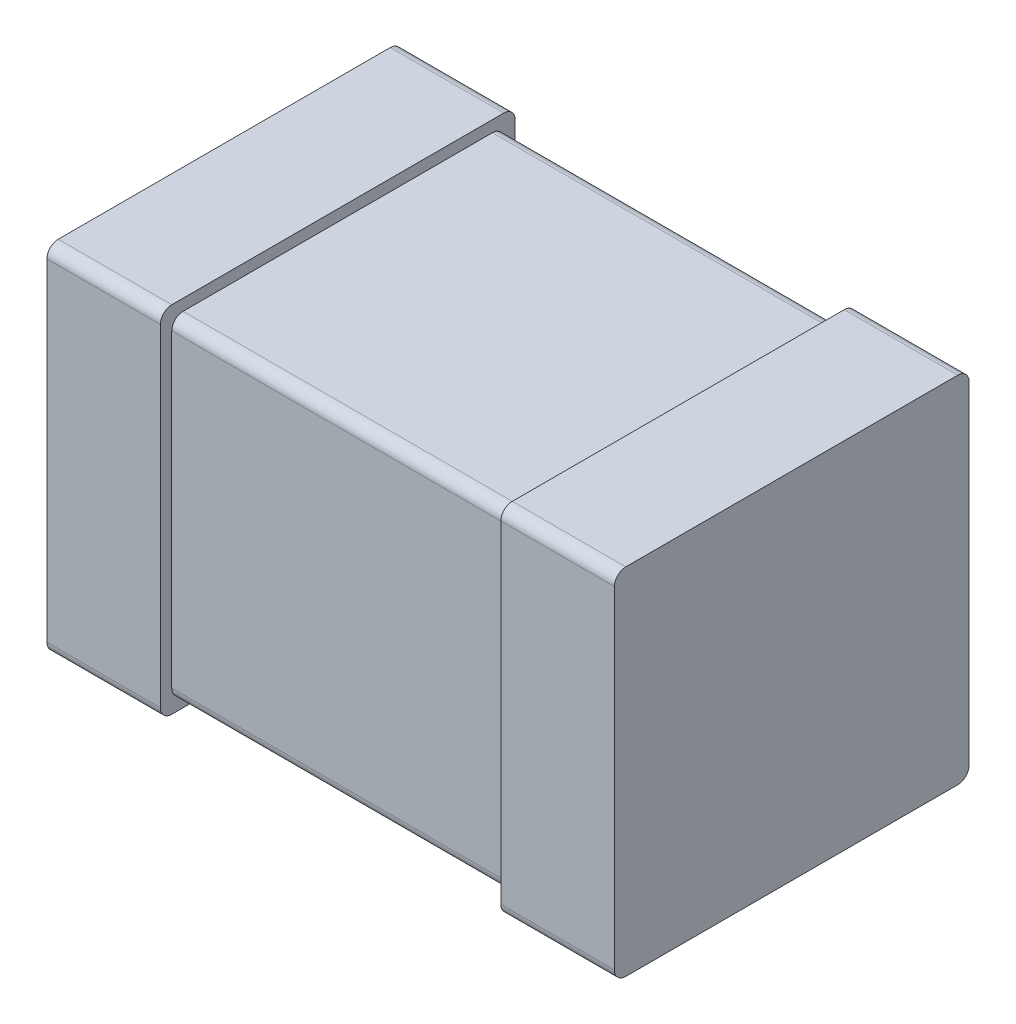
ISO-10303-21;
HEADER;
FILE_DESCRIPTION(('STEP AP214'),'2;1');
FILE_NAME('part.step','',(''),(''),'','','');
FILE_SCHEMA(('AUTOMOTIVE_DESIGN { 1 0 10303 214 1 1 1 1 }'));
ENDSEC;
DATA;
#1=APPLICATION_CONTEXT('core data for automotive mechanical design processes');
#2=APPLICATION_PROTOCOL_DEFINITION('international standard','automotive_design',2000,#1);
#3=PRODUCT_CONTEXT('',#1,'mechanical');
#4=PRODUCT('Part','Part','',(#3));
#5=PRODUCT_RELATED_PRODUCT_CATEGORY('part','',(#4));
#6=PRODUCT_DEFINITION_FORMATION('','',#4);
#7=PRODUCT_DEFINITION_CONTEXT('part definition',#1,'design');
#8=PRODUCT_DEFINITION('design','',#6,#7);
#9=PRODUCT_DEFINITION_SHAPE('','',#8);
#10=(LENGTH_UNIT() NAMED_UNIT(*) SI_UNIT(.MILLI.,.METRE.));
#11=(NAMED_UNIT(*) PLANE_ANGLE_UNIT() SI_UNIT($,.RADIAN.));
#12=(NAMED_UNIT(*) SI_UNIT($,.STERADIAN.) SOLID_ANGLE_UNIT());
#13=UNCERTAINTY_MEASURE_WITH_UNIT(LENGTH_MEASURE(1.E-05),#10,'distance_accuracy_value','');
#14=(GEOMETRIC_REPRESENTATION_CONTEXT(3) GLOBAL_UNCERTAINTY_ASSIGNED_CONTEXT((#13)) GLOBAL_UNIT_ASSIGNED_CONTEXT((#10,
#11,#12)) REPRESENTATION_CONTEXT('',''));
#15=CARTESIAN_POINT('',(0.,0.,0.));
#16=DIRECTION('',(0.,0.,1.));
#17=DIRECTION('',(1.,0.,0.));
#18=AXIS2_PLACEMENT_3D('',#15,#16,#17);
#19=CARTESIAN_POINT('',(1.,-0.625,0.));
#20=DIRECTION('',(1.,0.,0.));
#21=DIRECTION('',(0.,1.,0.));
#22=AXIS2_PLACEMENT_3D('',#19,#20,#21);
#23=PLANE('',#22);
#24=DIRECTION('',(0.,0.,1.));
#25=VECTOR('',#24,1.);
#26=CARTESIAN_POINT('',(1.,-0.625,0.));
#27=LINE('',#26,#25);
#28=CARTESIAN_POINT('',(1.,-0.625,0.04));
#29=VERTEX_POINT('',#28);
#30=CARTESIAN_POINT('',(1.,-0.625,1.21));
#31=VERTEX_POINT('',#30);
#32=EDGE_CURVE('E421',#29,#31,#27,.T.);
#33=ORIENTED_EDGE('',*,*,#32,.F.);
#34=CARTESIAN_POINT('',(1.,-0.585,0.04));
#35=DIRECTION('',(1.,0.,0.));
#36=DIRECTION('',(0.,0.,1.));
#37=AXIS2_PLACEMENT_3D('',#34,#35,#36);
#38=CIRCLE('',#37,0.04);
#39=CARTESIAN_POINT('',(1.,-0.585,0.));
#40=VERTEX_POINT('',#39);
#41=EDGE_CURVE('E294',#29,#40,#38,.T.);
#42=ORIENTED_EDGE('',*,*,#41,.T.);
#43=DIRECTION('',(0.,1.,0.));
#44=VECTOR('',#43,1.);
#45=CARTESIAN_POINT('',(1.,-0.625,0.));
#46=LINE('',#45,#44);
#47=CARTESIAN_POINT('',(1.,0.585,0.));
#48=VERTEX_POINT('',#47);
#49=EDGE_CURVE('E327',#40,#48,#46,.T.);
#50=ORIENTED_EDGE('',*,*,#49,.T.);
#51=CARTESIAN_POINT('',(1.,0.585,0.04));
#52=DIRECTION('',(-1.,0.,0.));
#53=DIRECTION('',(0.,0.,1.));
#54=AXIS2_PLACEMENT_3D('',#51,#52,#53);
#55=CIRCLE('',#54,0.04);
#56=CARTESIAN_POINT('',(1.,0.625,0.04));
#57=VERTEX_POINT('',#56);
#58=EDGE_CURVE('E342',#57,#48,#55,.T.);
#59=ORIENTED_EDGE('',*,*,#58,.F.);
#60=DIRECTION('',(0.,0.,1.));
#61=VECTOR('',#60,1.);
#62=CARTESIAN_POINT('',(1.,0.625,0.));
#63=LINE('',#62,#61);
#64=CARTESIAN_POINT('',(1.,0.625,1.21));
#65=VERTEX_POINT('',#64);
#66=EDGE_CURVE('E11',#57,#65,#63,.T.);
#67=ORIENTED_EDGE('',*,*,#66,.T.);
#68=CARTESIAN_POINT('',(1.,0.585,1.21));
#69=DIRECTION('',(1.,0.,0.));
#70=DIRECTION('',(0.,0.,1.));
#71=AXIS2_PLACEMENT_3D('',#68,#69,#70);
#72=CIRCLE('',#71,0.04);
#73=CARTESIAN_POINT('',(1.,0.585,1.25));
#74=VERTEX_POINT('',#73);
#75=EDGE_CURVE('E397',#65,#74,#72,.T.);
#76=ORIENTED_EDGE('',*,*,#75,.T.);
#77=DIRECTION('',(0.,1.,0.));
#78=VECTOR('',#77,1.);
#79=CARTESIAN_POINT('',(1.,-0.625,1.25));
#80=LINE('',#79,#78);
#81=CARTESIAN_POINT('',(1.,-0.585,1.25));
#82=VERTEX_POINT('',#81);
#83=EDGE_CURVE('E322',#82,#74,#80,.T.);
#84=ORIENTED_EDGE('',*,*,#83,.F.);
#85=CARTESIAN_POINT('',(1.,-0.585,1.21));
#86=DIRECTION('',(-1.,0.,0.));
#87=DIRECTION('',(0.,0.,1.));
#88=AXIS2_PLACEMENT_3D('',#85,#86,#87);
#89=CIRCLE('',#88,0.04);
#90=EDGE_CURVE('E298',#31,#82,#89,.T.);
#91=ORIENTED_EDGE('',*,*,#90,.F.);
#92=EDGE_LOOP('',(#33,#42,#50,#59,#67,#76,#84,#91));
#93=FACE_BOUND('',#92,.T.);
#94=ADVANCED_FACE('F17',(#93),#23,.T.);
#95=CARTESIAN_POINT('',(0.6,0.625,0.));
#96=DIRECTION('',(0.,1.,0.));
#97=DIRECTION('',(1.,0.,0.));
#98=AXIS2_PLACEMENT_3D('',#95,#96,#97);
#99=PLANE('',#98);
#100=ORIENTED_EDGE('',*,*,#66,.F.);
#101=DIRECTION('',(1.,0.,0.));
#102=VECTOR('',#101,1.);
#103=CARTESIAN_POINT('',(0.6,0.625,0.04));
#104=LINE('',#103,#102);
#105=CARTESIAN_POINT('',(0.6,0.625,0.04));
#106=VERTEX_POINT('',#105);
#107=EDGE_CURVE('E338',#106,#57,#104,.T.);
#108=ORIENTED_EDGE('',*,*,#107,.F.);
#109=DIRECTION('',(0.,0.,1.));
#110=VECTOR('',#109,1.);
#111=CARTESIAN_POINT('',(0.6,0.625,0.));
#112=LINE('',#111,#110);
#113=CARTESIAN_POINT('',(0.6,0.625,1.21));
#114=VERTEX_POINT('',#113);
#115=EDGE_CURVE('E357',#106,#114,#112,.T.);
#116=ORIENTED_EDGE('',*,*,#115,.T.);
#117=DIRECTION('',(1.,0.,0.));
#118=VECTOR('',#117,1.);
#119=CARTESIAN_POINT('',(0.6,0.625,1.21));
#120=LINE('',#119,#118);
#121=EDGE_CURVE('E28',#114,#65,#120,.T.);
#122=ORIENTED_EDGE('',*,*,#121,.T.);
#123=EDGE_LOOP('',(#100,#108,#116,#122));
#124=FACE_BOUND('',#123,.T.);
#125=ADVANCED_FACE('F521',(#124),#99,.T.);
#126=CARTESIAN_POINT('',(0.6,0.585,1.21));
#127=DIRECTION('',(1.,0.,0.));
#128=DIRECTION('',(0.,1.,0.));
#129=AXIS2_PLACEMENT_3D('',#126,#127,#128);
#130=CYLINDRICAL_SURFACE('',#129,0.04);
#131=CARTESIAN_POINT('',(0.6,0.585,1.21));
#132=DIRECTION('',(1.,0.,0.));
#133=DIRECTION('',(0.,0.,1.));
#134=AXIS2_PLACEMENT_3D('',#131,#132,#133);
#135=CIRCLE('',#134,0.04);
#136=CARTESIAN_POINT('',(0.6,0.585,1.25));
#137=VERTEX_POINT('',#136);
#138=EDGE_CURVE('E321',#114,#137,#135,.T.);
#139=ORIENTED_EDGE('',*,*,#138,.T.);
#140=DIRECTION('',(1.,0.,0.));
#141=VECTOR('',#140,1.);
#142=CARTESIAN_POINT('',(0.6,0.585,1.25));
#143=LINE('',#142,#141);
#144=EDGE_CURVE('E326',#137,#74,#143,.T.);
#145=ORIENTED_EDGE('',*,*,#144,.T.);
#146=ORIENTED_EDGE('',*,*,#75,.F.);
#147=ORIENTED_EDGE('',*,*,#121,.F.);
#148=EDGE_LOOP('',(#139,#145,#146,#147));
#149=FACE_BOUND('',#148,.T.);
#150=ADVANCED_FACE('F528',(#149),#130,.T.);
#151=CARTESIAN_POINT('',(0.6,0.585,0.04));
#152=DIRECTION('',(1.,0.,0.));
#153=DIRECTION('',(0.,1.,0.));
#154=AXIS2_PLACEMENT_3D('',#151,#152,#153);
#155=CYLINDRICAL_SURFACE('',#154,0.04);
#156=ORIENTED_EDGE('',*,*,#107,.T.);
#157=ORIENTED_EDGE('',*,*,#58,.T.);
#158=DIRECTION('',(1.,0.,0.));
#159=VECTOR('',#158,1.);
#160=CARTESIAN_POINT('',(0.6,0.585,0.));
#161=LINE('',#160,#159);
#162=CARTESIAN_POINT('',(0.6,0.585,0.));
#163=VERTEX_POINT('',#162);
#164=EDGE_CURVE('E365',#163,#48,#161,.T.);
#165=ORIENTED_EDGE('',*,*,#164,.F.);
#166=CARTESIAN_POINT('',(0.6,0.585,0.04));
#167=DIRECTION('',(-1.,0.,0.));
#168=DIRECTION('',(0.,0.,1.));
#169=AXIS2_PLACEMENT_3D('',#166,#167,#168);
#170=CIRCLE('',#169,0.04);
#171=EDGE_CURVE('E352',#106,#163,#170,.T.);
#172=ORIENTED_EDGE('',*,*,#171,.F.);
#173=EDGE_LOOP('',(#156,#157,#165,#172));
#174=FACE_BOUND('',#173,.T.);
#175=ADVANCED_FACE('F547',(#174),#155,.T.);
#176=CARTESIAN_POINT('',(0.6,-0.625,1.25));
#177=DIRECTION('',(0.,0.,1.));
#178=DIRECTION('',(1.,0.,0.));
#179=AXIS2_PLACEMENT_3D('',#176,#177,#178);
#180=PLANE('',#179);
#181=DIRECTION('',(0.,1.,0.));
#182=VECTOR('',#181,1.);
#183=CARTESIAN_POINT('',(0.6,-0.625,1.25));
#184=LINE('',#183,#182);
#185=CARTESIAN_POINT('',(0.6,-0.585,1.25));
#186=VERTEX_POINT('',#185);
#187=EDGE_CURVE('E317',#186,#137,#184,.T.);
#188=ORIENTED_EDGE('',*,*,#187,.F.);
#189=DIRECTION('',(1.,0.,0.));
#190=VECTOR('',#189,1.);
#191=CARTESIAN_POINT('',(0.6,-0.585,1.25));
#192=LINE('',#191,#190);
#193=EDGE_CURVE('E281',#186,#82,#192,.T.);
#194=ORIENTED_EDGE('',*,*,#193,.T.);
#195=ORIENTED_EDGE('',*,*,#83,.T.);
#196=ORIENTED_EDGE('',*,*,#144,.F.);
#197=EDGE_LOOP('',(#188,#194,#195,#196));
#198=FACE_BOUND('',#197,.T.);
#199=ADVANCED_FACE('F532',(#198),#180,.T.);
#200=CARTESIAN_POINT('',(0.6,-0.625,0.));
#201=DIRECTION('',(0.,0.,1.));
#202=DIRECTION('',(1.,0.,0.));
#203=AXIS2_PLACEMENT_3D('',#200,#201,#202);
#204=PLANE('',#203);
#205=ORIENTED_EDGE('',*,*,#164,.T.);
#206=ORIENTED_EDGE('',*,*,#49,.F.);
#207=DIRECTION('',(1.,0.,0.));
#208=VECTOR('',#207,1.);
#209=CARTESIAN_POINT('',(0.6,-0.585,0.));
#210=LINE('',#209,#208);
#211=CARTESIAN_POINT('',(0.6,-0.585,0.));
#212=VERTEX_POINT('',#211);
#213=EDGE_CURVE('E21',#212,#40,#210,.T.);
#214=ORIENTED_EDGE('',*,*,#213,.F.);
#215=DIRECTION('',(0.,1.,0.));
#216=VECTOR('',#215,1.);
#217=CARTESIAN_POINT('',(0.6,-0.625,0.));
#218=LINE('',#217,#216);
#219=EDGE_CURVE('E356',#212,#163,#218,.T.);
#220=ORIENTED_EDGE('',*,*,#219,.T.);
#221=EDGE_LOOP('',(#205,#206,#214,#220));
#222=FACE_BOUND('',#221,.T.);
#223=ADVANCED_FACE('F545',(#222),#204,.F.);
#224=CARTESIAN_POINT('',(0.6,-0.585,1.21));
#225=DIRECTION('',(1.,0.,0.));
#226=DIRECTION('',(0.,-1.,0.));
#227=AXIS2_PLACEMENT_3D('',#224,#225,#226);
#228=CYLINDRICAL_SURFACE('',#227,0.04);
#229=DIRECTION('',(1.,0.,0.));
#230=VECTOR('',#229,1.);
#231=CARTESIAN_POINT('',(0.6,-0.625,1.21));
#232=LINE('',#231,#230);
#233=CARTESIAN_POINT('',(0.6,-0.625,1.21));
#234=VERTEX_POINT('',#233);
#235=EDGE_CURVE('E374',#234,#31,#232,.T.);
#236=ORIENTED_EDGE('',*,*,#235,.T.);
#237=ORIENTED_EDGE('',*,*,#90,.T.);
#238=ORIENTED_EDGE('',*,*,#193,.F.);
#239=CARTESIAN_POINT('',(0.6,-0.585,1.21));
#240=DIRECTION('',(-1.,0.,0.));
#241=DIRECTION('',(0.,0.,1.));
#242=AXIS2_PLACEMENT_3D('',#239,#240,#241);
#243=CIRCLE('',#242,0.04);
#244=EDGE_CURVE('E313',#234,#186,#243,.T.);
#245=ORIENTED_EDGE('',*,*,#244,.F.);
#246=EDGE_LOOP('',(#236,#237,#238,#245));
#247=FACE_BOUND('',#246,.T.);
#248=ADVANCED_FACE('F535',(#247),#228,.T.);
#249=CARTESIAN_POINT('',(0.6,-0.585,0.04));
#250=DIRECTION('',(1.,0.,0.));
#251=DIRECTION('',(0.,-1.,0.));
#252=AXIS2_PLACEMENT_3D('',#249,#250,#251);
#253=CYLINDRICAL_SURFACE('',#252,0.04);
#254=CARTESIAN_POINT('',(0.6,-0.585,0.04));
#255=DIRECTION('',(1.,0.,0.));
#256=DIRECTION('',(0.,0.,1.));
#257=AXIS2_PLACEMENT_3D('',#254,#255,#256);
#258=CIRCLE('',#257,0.04);
#259=CARTESIAN_POINT('',(0.6,-0.625,0.04));
#260=VERTEX_POINT('',#259);
#261=EDGE_CURVE('E396',#260,#212,#258,.T.);
#262=ORIENTED_EDGE('',*,*,#261,.T.);
#263=ORIENTED_EDGE('',*,*,#213,.T.);
#264=ORIENTED_EDGE('',*,*,#41,.F.);
#265=DIRECTION('',(1.,0.,0.));
#266=VECTOR('',#265,1.);
#267=CARTESIAN_POINT('',(0.6,-0.625,0.04));
#268=LINE('',#267,#266);
#269=EDGE_CURVE('E378',#260,#29,#268,.T.);
#270=ORIENTED_EDGE('',*,*,#269,.F.);
#271=EDGE_LOOP('',(#262,#263,#264,#270));
#272=FACE_BOUND('',#271,.T.);
#273=ADVANCED_FACE('F543',(#272),#253,.T.);
#274=CARTESIAN_POINT('',(0.6,-0.625,0.));
#275=DIRECTION('',(0.,1.,0.));
#276=DIRECTION('',(1.,0.,0.));
#277=AXIS2_PLACEMENT_3D('',#274,#275,#276);
#278=PLANE('',#277);
#279=ORIENTED_EDGE('',*,*,#235,.F.);
#280=DIRECTION('',(0.,0.,1.));
#281=VECTOR('',#280,1.);
#282=CARTESIAN_POINT('',(0.6,-0.625,0.));
#283=LINE('',#282,#281);
#284=EDGE_CURVE('E379',#260,#234,#283,.T.);
#285=ORIENTED_EDGE('',*,*,#284,.F.);
#286=ORIENTED_EDGE('',*,*,#269,.T.);
#287=ORIENTED_EDGE('',*,*,#32,.T.);
#288=EDGE_LOOP('',(#279,#285,#286,#287));
#289=FACE_BOUND('',#288,.T.);
#290=ADVANCED_FACE('F538',(#289),#278,.F.);
#291=CARTESIAN_POINT('',(0.6,-0.625,0.));
#292=DIRECTION('',(1.,0.,0.));
#293=DIRECTION('',(0.,1.,0.));
#294=AXIS2_PLACEMENT_3D('',#291,#292,#293);
#295=PLANE('',#294);
#296=DIRECTION('',(0.,1.,0.));
#297=VECTOR('',#296,1.);
#298=CARTESIAN_POINT('',(0.6,-0.585,0.04));
#299=LINE('',#298,#297);
#300=CARTESIAN_POINT('',(0.6,-0.545,0.04));
#301=VERTEX_POINT('',#300);
#302=CARTESIAN_POINT('',(0.6,0.545,0.04));
#303=VERTEX_POINT('',#302);
#304=EDGE_CURVE('E309',#301,#303,#299,.T.);
#305=ORIENTED_EDGE('',*,*,#304,.T.);
#306=CARTESIAN_POINT('',(0.6,0.545,0.08));
#307=DIRECTION('',(-1.,0.,0.));
#308=DIRECTION('',(0.,0.,1.));
#309=AXIS2_PLACEMENT_3D('',#306,#307,#308);
#310=CIRCLE('',#309,0.04);
#311=CARTESIAN_POINT('',(0.6,0.585,0.08));
#312=VERTEX_POINT('',#311);
#313=EDGE_CURVE('E308',#312,#303,#310,.T.);
#314=ORIENTED_EDGE('',*,*,#313,.F.);
#315=DIRECTION('',(0.,0.,1.));
#316=VECTOR('',#315,1.);
#317=CARTESIAN_POINT('',(0.6,0.585,0.04));
#318=LINE('',#317,#316);
#319=CARTESIAN_POINT('',(0.6,0.585,1.17));
#320=VERTEX_POINT('',#319);
#321=EDGE_CURVE('E316',#312,#320,#318,.T.);
#322=ORIENTED_EDGE('',*,*,#321,.T.);
#323=CARTESIAN_POINT('',(0.6,0.545,1.17));
#324=DIRECTION('',(1.,0.,0.));
#325=DIRECTION('',(0.,0.,1.));
#326=AXIS2_PLACEMENT_3D('',#323,#324,#325);
#327=CIRCLE('',#326,0.04);
#328=CARTESIAN_POINT('',(0.6,0.545,1.21));
#329=VERTEX_POINT('',#328);
#330=EDGE_CURVE('E254',#320,#329,#327,.T.);
#331=ORIENTED_EDGE('',*,*,#330,.T.);
#332=DIRECTION('',(0.,1.,0.));
#333=VECTOR('',#332,1.);
#334=CARTESIAN_POINT('',(0.6,-0.585,1.21));
#335=LINE('',#334,#333);
#336=CARTESIAN_POINT('',(0.6,-0.545,1.21));
#337=VERTEX_POINT('',#336);
#338=EDGE_CURVE('E253',#337,#329,#335,.T.);
#339=ORIENTED_EDGE('',*,*,#338,.F.);
#340=CARTESIAN_POINT('',(0.6,-0.545,1.17));
#341=DIRECTION('',(-1.,0.,0.));
#342=DIRECTION('',(0.,0.,1.));
#343=AXIS2_PLACEMENT_3D('',#340,#341,#342);
#344=CIRCLE('',#343,0.04);
#345=CARTESIAN_POINT('',(0.6,-0.585,1.17));
#346=VERTEX_POINT('',#345);
#347=EDGE_CURVE('E249',#346,#337,#344,.T.);
#348=ORIENTED_EDGE('',*,*,#347,.F.);
#349=DIRECTION('',(0.,0.,1.));
#350=VECTOR('',#349,1.);
#351=CARTESIAN_POINT('',(0.6,-0.585,0.04));
#352=LINE('',#351,#350);
#353=CARTESIAN_POINT('',(0.6,-0.585,0.08));
#354=VERTEX_POINT('',#353);
#355=EDGE_CURVE('E310',#354,#346,#352,.T.);
#356=ORIENTED_EDGE('',*,*,#355,.F.);
#357=CARTESIAN_POINT('',(0.6,-0.545,0.08));
#358=DIRECTION('',(1.,0.,0.));
#359=DIRECTION('',(0.,0.,1.));
#360=AXIS2_PLACEMENT_3D('',#357,#358,#359);
#361=CIRCLE('',#360,0.04);
#362=EDGE_CURVE('E337',#354,#301,#361,.T.);
#363=ORIENTED_EDGE('',*,*,#362,.T.);
#364=EDGE_LOOP('',(#305,#314,#322,#331,#339,#348,#356,#363));
#365=FACE_BOUND('',#364,.T.);
#366=ORIENTED_EDGE('',*,*,#244,.T.);
#367=ORIENTED_EDGE('',*,*,#187,.T.);
#368=ORIENTED_EDGE('',*,*,#138,.F.);
#369=ORIENTED_EDGE('',*,*,#115,.F.);
#370=ORIENTED_EDGE('',*,*,#171,.T.);
#371=ORIENTED_EDGE('',*,*,#219,.F.);
#372=ORIENTED_EDGE('',*,*,#261,.F.);
#373=ORIENTED_EDGE('',*,*,#284,.T.);
#374=EDGE_LOOP('',(#366,#367,#368,#369,#370,#371,#372,#373));
#375=FACE_BOUND('',#374,.T.);
#376=ADVANCED_FACE('F525',(#365,#375),#295,.F.);
#377=CARTESIAN_POINT('',(-0.6,-0.585,0.04));
#378=DIRECTION('',(0.,1.,0.));
#379=DIRECTION('',(1.,0.,0.));
#380=AXIS2_PLACEMENT_3D('',#377,#378,#379);
#381=PLANE('',#380);
#382=DIRECTION('',(1.,0.,0.));
#383=VECTOR('',#382,1.);
#384=CARTESIAN_POINT('',(-0.6,-0.585,1.17));
#385=LINE('',#384,#383);
#386=CARTESIAN_POINT('',(-0.6,-0.585,1.17));
#387=VERTEX_POINT('',#386);
#388=EDGE_CURVE('E236',#387,#346,#385,.T.);
#389=ORIENTED_EDGE('',*,*,#388,.F.);
#390=DIRECTION('',(0.,0.,1.));
#391=VECTOR('',#390,1.);
#392=CARTESIAN_POINT('',(-0.6,-0.585,0.04));
#393=LINE('',#392,#391);
#394=CARTESIAN_POINT('',(-0.6,-0.585,0.08));
#395=VERTEX_POINT('',#394);
#396=EDGE_CURVE('E270',#395,#387,#393,.T.);
#397=ORIENTED_EDGE('',*,*,#396,.F.);
#398=DIRECTION('',(1.,0.,0.));
#399=VECTOR('',#398,1.);
#400=CARTESIAN_POINT('',(-0.6,-0.585,0.08));
#401=LINE('',#400,#399);
#402=EDGE_CURVE('E332',#395,#354,#401,.T.);
#403=ORIENTED_EDGE('',*,*,#402,.T.);
#404=ORIENTED_EDGE('',*,*,#355,.T.);
#405=EDGE_LOOP('',(#389,#397,#403,#404));
#406=FACE_BOUND('',#405,.T.);
#407=ADVANCED_FACE('F604',(#406),#381,.F.);
#408=CARTESIAN_POINT('',(-0.6,-0.545,1.17));
#409=DIRECTION('',(1.,0.,0.));
#410=DIRECTION('',(0.,-1.,0.));
#411=AXIS2_PLACEMENT_3D('',#408,#409,#410);
#412=CYLINDRICAL_SURFACE('',#411,0.04);
#413=ORIENTED_EDGE('',*,*,#388,.T.);
#414=ORIENTED_EDGE('',*,*,#347,.T.);
#415=DIRECTION('',(1.,0.,0.));
#416=VECTOR('',#415,1.);
#417=CARTESIAN_POINT('',(-0.6,-0.545,1.21));
#418=LINE('',#417,#416);
#419=CARTESIAN_POINT('',(-0.6,-0.545,1.21));
#420=VERTEX_POINT('',#419);
#421=EDGE_CURVE('E242',#420,#337,#418,.T.);
#422=ORIENTED_EDGE('',*,*,#421,.F.);
#423=CARTESIAN_POINT('',(-0.6,-0.545,1.17));
#424=DIRECTION('',(-1.,0.,0.));
#425=DIRECTION('',(0.,0.,1.));
#426=AXIS2_PLACEMENT_3D('',#423,#424,#425);
#427=CIRCLE('',#426,0.04);
#428=EDGE_CURVE('E246',#387,#420,#427,.T.);
#429=ORIENTED_EDGE('',*,*,#428,.F.);
#430=EDGE_LOOP('',(#413,#414,#422,#429));
#431=FACE_BOUND('',#430,.T.);
#432=ADVANCED_FACE('F244',(#431),#412,.T.);
#433=CARTESIAN_POINT('',(-0.6,-0.585,1.21));
#434=DIRECTION('',(0.,0.,1.));
#435=DIRECTION('',(1.,0.,0.));
#436=AXIS2_PLACEMENT_3D('',#433,#434,#435);
#437=PLANE('',#436);
#438=DIRECTION('',(0.,1.,0.));
#439=VECTOR('',#438,1.);
#440=CARTESIAN_POINT('',(-0.6,-0.585,1.21));
#441=LINE('',#440,#439);
#442=CARTESIAN_POINT('',(-0.6,0.545,1.21));
#443=VERTEX_POINT('',#442);
#444=EDGE_CURVE('E257',#420,#443,#441,.T.);
#445=ORIENTED_EDGE('',*,*,#444,.F.);
#446=ORIENTED_EDGE('',*,*,#421,.T.);
#447=ORIENTED_EDGE('',*,*,#338,.T.);
#448=DIRECTION('',(1.,0.,0.));
#449=VECTOR('',#448,1.);
#450=CARTESIAN_POINT('',(-0.6,0.545,1.21));
#451=LINE('',#450,#449);
#452=EDGE_CURVE('E260',#443,#329,#451,.T.);
#453=ORIENTED_EDGE('',*,*,#452,.F.);
#454=EDGE_LOOP('',(#445,#446,#447,#453));
#455=FACE_BOUND('',#454,.T.);
#456=ADVANCED_FACE('F258',(#455),#437,.T.);
#457=CARTESIAN_POINT('',(-0.6,0.545,1.17));
#458=DIRECTION('',(1.,0.,0.));
#459=DIRECTION('',(0.,1.,0.));
#460=AXIS2_PLACEMENT_3D('',#457,#458,#459);
#461=CYLINDRICAL_SURFACE('',#460,0.04);
#462=CARTESIAN_POINT('',(-0.6,0.545,1.17));
#463=DIRECTION('',(1.,0.,0.));
#464=DIRECTION('',(0.,0.,1.));
#465=AXIS2_PLACEMENT_3D('',#462,#463,#464);
#466=CIRCLE('',#465,0.04);
#467=CARTESIAN_POINT('',(-0.6,0.585,1.17));
#468=VERTEX_POINT('',#467);
#469=EDGE_CURVE('E265',#468,#443,#466,.T.);
#470=ORIENTED_EDGE('',*,*,#469,.T.);
#471=ORIENTED_EDGE('',*,*,#452,.T.);
#472=ORIENTED_EDGE('',*,*,#330,.F.);
#473=DIRECTION('',(1.,0.,0.));
#474=VECTOR('',#473,1.);
#475=CARTESIAN_POINT('',(-0.6,0.585,1.17));
#476=LINE('',#475,#474);
#477=EDGE_CURVE('E364',#468,#320,#476,.T.);
#478=ORIENTED_EDGE('',*,*,#477,.F.);
#479=EDGE_LOOP('',(#470,#471,#472,#478));
#480=FACE_BOUND('',#479,.T.);
#481=ADVANCED_FACE('F569',(#480),#461,.T.);
#482=CARTESIAN_POINT('',(-0.6,0.585,0.04));
#483=DIRECTION('',(0.,1.,0.));
#484=DIRECTION('',(1.,0.,0.));
#485=AXIS2_PLACEMENT_3D('',#482,#483,#484);
#486=PLANE('',#485);
#487=ORIENTED_EDGE('',*,*,#321,.F.);
#488=DIRECTION('',(1.,0.,0.));
#489=VECTOR('',#488,1.);
#490=CARTESIAN_POINT('',(-0.6,0.585,0.08));
#491=LINE('',#490,#489);
#492=CARTESIAN_POINT('',(-0.6,0.585,0.08));
#493=VERTEX_POINT('',#492);
#494=EDGE_CURVE('E304',#493,#312,#491,.T.);
#495=ORIENTED_EDGE('',*,*,#494,.F.);
#496=DIRECTION('',(0.,0.,1.));
#497=VECTOR('',#496,1.);
#498=CARTESIAN_POINT('',(-0.6,0.585,0.04));
#499=LINE('',#498,#497);
#500=EDGE_CURVE('E345',#493,#468,#499,.T.);
#501=ORIENTED_EDGE('',*,*,#500,.T.);
#502=ORIENTED_EDGE('',*,*,#477,.T.);
#503=EDGE_LOOP('',(#487,#495,#501,#502));
#504=FACE_BOUND('',#503,.T.);
#505=ADVANCED_FACE('F574',(#504),#486,.T.);
#506=CARTESIAN_POINT('',(-0.6,0.545,0.08));
#507=DIRECTION('',(1.,0.,0.));
#508=DIRECTION('',(0.,1.,0.));
#509=AXIS2_PLACEMENT_3D('',#506,#507,#508);
#510=CYLINDRICAL_SURFACE('',#509,0.04);
#511=ORIENTED_EDGE('',*,*,#494,.T.);
#512=ORIENTED_EDGE('',*,*,#313,.T.);
#513=DIRECTION('',(1.,0.,0.));
#514=VECTOR('',#513,1.);
#515=CARTESIAN_POINT('',(-0.6,0.545,0.04));
#516=LINE('',#515,#514);
#517=CARTESIAN_POINT('',(-0.6,0.545,0.04));
#518=VERTEX_POINT('',#517);
#519=EDGE_CURVE('E336',#518,#303,#516,.T.);
#520=ORIENTED_EDGE('',*,*,#519,.F.);
#521=CARTESIAN_POINT('',(-0.6,0.545,0.08));
#522=DIRECTION('',(-1.,0.,0.));
#523=DIRECTION('',(0.,0.,1.));
#524=AXIS2_PLACEMENT_3D('',#521,#522,#523);
#525=CIRCLE('',#524,0.04);
#526=EDGE_CURVE('E434',#493,#518,#525,.T.);
#527=ORIENTED_EDGE('',*,*,#526,.F.);
#528=EDGE_LOOP('',(#511,#512,#520,#527));
#529=FACE_BOUND('',#528,.T.);
#530=ADVANCED_FACE('F570',(#529),#510,.T.);
#531=CARTESIAN_POINT('',(-0.6,-0.585,0.04));
#532=DIRECTION('',(0.,0.,1.));
#533=DIRECTION('',(1.,0.,0.));
#534=AXIS2_PLACEMENT_3D('',#531,#532,#533);
#535=PLANE('',#534);
#536=ORIENTED_EDGE('',*,*,#519,.T.);
#537=ORIENTED_EDGE('',*,*,#304,.F.);
#538=DIRECTION('',(1.,0.,0.));
#539=VECTOR('',#538,1.);
#540=CARTESIAN_POINT('',(-0.6,-0.545,0.04));
#541=LINE('',#540,#539);
#542=CARTESIAN_POINT('',(-0.6,-0.545,0.04));
#543=VERTEX_POINT('',#542);
#544=EDGE_CURVE('E433',#543,#301,#541,.T.);
#545=ORIENTED_EDGE('',*,*,#544,.F.);
#546=DIRECTION('',(0.,1.,0.));
#547=VECTOR('',#546,1.);
#548=CARTESIAN_POINT('',(-0.6,-0.585,0.04));
#549=LINE('',#548,#547);
#550=EDGE_CURVE('E429',#543,#518,#549,.T.);
#551=ORIENTED_EDGE('',*,*,#550,.T.);
#552=EDGE_LOOP('',(#536,#537,#545,#551));
#553=FACE_BOUND('',#552,.T.);
#554=ADVANCED_FACE('F573',(#553),#535,.F.);
#555=CARTESIAN_POINT('',(-0.6,-0.545,0.08));
#556=DIRECTION('',(1.,0.,0.));
#557=DIRECTION('',(0.,-1.,0.));
#558=AXIS2_PLACEMENT_3D('',#555,#556,#557);
#559=CYLINDRICAL_SURFACE('',#558,0.04);
#560=CARTESIAN_POINT('',(-0.6,-0.545,0.08));
#561=DIRECTION('',(1.,0.,0.));
#562=DIRECTION('',(0.,0.,1.));
#563=AXIS2_PLACEMENT_3D('',#560,#561,#562);
#564=CIRCLE('',#563,0.04);
#565=EDGE_CURVE('E277',#395,#543,#564,.T.);
#566=ORIENTED_EDGE('',*,*,#565,.T.);
#567=ORIENTED_EDGE('',*,*,#544,.T.);
#568=ORIENTED_EDGE('',*,*,#362,.F.);
#569=ORIENTED_EDGE('',*,*,#402,.F.);
#570=EDGE_LOOP('',(#566,#567,#568,#569));
#571=FACE_BOUND('',#570,.T.);
#572=ADVANCED_FACE('F593',(#571),#559,.T.);
#573=CARTESIAN_POINT('',(-0.6,-0.625,0.));
#574=DIRECTION('',(1.,0.,0.));
#575=DIRECTION('',(0.,1.,0.));
#576=AXIS2_PLACEMENT_3D('',#573,#574,#575);
#577=PLANE('',#576);
#578=ORIENTED_EDGE('',*,*,#565,.F.);
#579=ORIENTED_EDGE('',*,*,#396,.T.);
#580=ORIENTED_EDGE('',*,*,#428,.T.);
#581=ORIENTED_EDGE('',*,*,#444,.T.);
#582=ORIENTED_EDGE('',*,*,#469,.F.);
#583=ORIENTED_EDGE('',*,*,#500,.F.);
#584=ORIENTED_EDGE('',*,*,#526,.T.);
#585=ORIENTED_EDGE('',*,*,#550,.F.);
#586=EDGE_LOOP('',(#578,#579,#580,#581,#582,#583,#584,#585));
#587=FACE_BOUND('',#586,.T.);
#588=DIRECTION('',(0.,0.,1.));
#589=VECTOR('',#588,1.);
#590=CARTESIAN_POINT('',(-0.6,-0.625,0.));
#591=LINE('',#590,#589);
#592=CARTESIAN_POINT('',(-0.6,-0.625,0.04));
#593=VERTEX_POINT('',#592);
#594=CARTESIAN_POINT('',(-0.6,-0.625,1.21));
#595=VERTEX_POINT('',#594);
#596=EDGE_CURVE('E331',#593,#595,#591,.T.);
#597=ORIENTED_EDGE('',*,*,#596,.F.);
#598=CARTESIAN_POINT('',(-0.6,-0.585,0.04));
#599=DIRECTION('',(1.,0.,0.));
#600=DIRECTION('',(0.,0.,1.));
#601=AXIS2_PLACEMENT_3D('',#598,#599,#600);
#602=CIRCLE('',#601,0.04);
#603=CARTESIAN_POINT('',(-0.6,-0.585,0.));
#604=VERTEX_POINT('',#603);
#605=EDGE_CURVE('E330',#593,#604,#602,.T.);
#606=ORIENTED_EDGE('',*,*,#605,.T.);
#607=DIRECTION('',(0.,1.,0.));
#608=VECTOR('',#607,1.);
#609=CARTESIAN_POINT('',(-0.6,-0.625,0.));
#610=LINE('',#609,#608);
#611=CARTESIAN_POINT('',(-0.6,0.585,0.));
#612=VERTEX_POINT('',#611);
#613=EDGE_CURVE('E288',#604,#612,#610,.T.);
#614=ORIENTED_EDGE('',*,*,#613,.T.);
#615=CARTESIAN_POINT('',(-0.6,0.585,0.04));
#616=DIRECTION('',(-1.,0.,0.));
#617=DIRECTION('',(0.,0.,1.));
#618=AXIS2_PLACEMENT_3D('',#615,#616,#617);
#619=CIRCLE('',#618,0.04);
#620=CARTESIAN_POINT('',(-0.6,0.625,0.04));
#621=VERTEX_POINT('',#620);
#622=EDGE_CURVE('E458',#621,#612,#619,.T.);
#623=ORIENTED_EDGE('',*,*,#622,.F.);
#624=DIRECTION('',(0.,0.,1.));
#625=VECTOR('',#624,1.);
#626=CARTESIAN_POINT('',(-0.6,0.625,0.));
#627=LINE('',#626,#625);
#628=CARTESIAN_POINT('',(-0.6,0.625,1.21));
#629=VERTEX_POINT('',#628);
#630=EDGE_CURVE('E407',#621,#629,#627,.T.);
#631=ORIENTED_EDGE('',*,*,#630,.T.);
#632=CARTESIAN_POINT('',(-0.6,0.585,1.21));
#633=DIRECTION('',(1.,0.,0.));
#634=DIRECTION('',(0.,0.,1.));
#635=AXIS2_PLACEMENT_3D('',#632,#633,#634);
#636=CIRCLE('',#635,0.04);
#637=CARTESIAN_POINT('',(-0.6,0.585,1.25));
#638=VERTEX_POINT('',#637);
#639=EDGE_CURVE('E455',#629,#638,#636,.T.);
#640=ORIENTED_EDGE('',*,*,#639,.T.);
#641=DIRECTION('',(0.,1.,0.));
#642=VECTOR('',#641,1.);
#643=CARTESIAN_POINT('',(-0.6,-0.625,1.25));
#644=LINE('',#643,#642);
#645=CARTESIAN_POINT('',(-0.6,-0.585,1.25));
#646=VERTEX_POINT('',#645);
#647=EDGE_CURVE('E292',#646,#638,#644,.T.);
#648=ORIENTED_EDGE('',*,*,#647,.F.);
#649=CARTESIAN_POINT('',(-0.6,-0.585,1.21));
#650=DIRECTION('',(-1.,0.,0.));
#651=DIRECTION('',(0.,0.,1.));
#652=AXIS2_PLACEMENT_3D('',#649,#650,#651);
#653=CIRCLE('',#652,0.04);
#654=EDGE_CURVE('E406',#595,#646,#653,.T.);
#655=ORIENTED_EDGE('',*,*,#654,.F.);
#656=EDGE_LOOP('',(#597,#606,#614,#623,#631,#640,#648,#655));
#657=FACE_BOUND('',#656,.T.);
#658=ADVANCED_FACE('F268',(#587,#657),#577,.T.);
#659=CARTESIAN_POINT('',(-1.,0.625,0.));
#660=DIRECTION('',(0.,1.,0.));
#661=DIRECTION('',(1.,0.,0.));
#662=AXIS2_PLACEMENT_3D('',#659,#660,#661);
#663=PLANE('',#662);
#664=ORIENTED_EDGE('',*,*,#630,.F.);
#665=DIRECTION('',(1.,0.,0.));
#666=VECTOR('',#665,1.);
#667=CARTESIAN_POINT('',(-1.,0.625,0.04));
#668=LINE('',#667,#666);
#669=CARTESIAN_POINT('',(-1.,0.625,0.04));
#670=VERTEX_POINT('',#669);
#671=EDGE_CURVE('E428',#670,#621,#668,.T.);
#672=ORIENTED_EDGE('',*,*,#671,.F.);
#673=DIRECTION('',(0.,0.,1.));
#674=VECTOR('',#673,1.);
#675=CARTESIAN_POINT('',(-1.,0.625,0.));
#676=LINE('',#675,#674);
#677=CARTESIAN_POINT('',(-1.,0.625,1.21));
#678=VERTEX_POINT('',#677);
#679=EDGE_CURVE('E299',#670,#678,#676,.T.);
#680=ORIENTED_EDGE('',*,*,#679,.T.);
#681=DIRECTION('',(1.,0.,0.));
#682=VECTOR('',#681,1.);
#683=CARTESIAN_POINT('',(-1.,0.625,1.21));
#684=LINE('',#683,#682);
#685=EDGE_CURVE('E410',#678,#629,#684,.T.);
#686=ORIENTED_EDGE('',*,*,#685,.T.);
#687=EDGE_LOOP('',(#664,#672,#680,#686));
#688=FACE_BOUND('',#687,.T.);
#689=ADVANCED_FACE('F618',(#688),#663,.T.);
#690=CARTESIAN_POINT('',(-1.,0.585,1.21));
#691=DIRECTION('',(1.,0.,0.));
#692=DIRECTION('',(0.,1.,0.));
#693=AXIS2_PLACEMENT_3D('',#690,#691,#692);
#694=CYLINDRICAL_SURFACE('',#693,0.04);
#695=CARTESIAN_POINT('',(-1.,0.585,1.21));
#696=DIRECTION('',(1.,0.,0.));
#697=DIRECTION('',(0.,0.,1.));
#698=AXIS2_PLACEMENT_3D('',#695,#696,#697);
#699=CIRCLE('',#698,0.04);
#700=CARTESIAN_POINT('',(-1.,0.585,1.25));
#701=VERTEX_POINT('',#700);
#702=EDGE_CURVE('E286',#678,#701,#699,.T.);
#703=ORIENTED_EDGE('',*,*,#702,.T.);
#704=DIRECTION('',(1.,0.,0.));
#705=VECTOR('',#704,1.);
#706=CARTESIAN_POINT('',(-1.,0.585,1.25));
#707=LINE('',#706,#705);
#708=EDGE_CURVE('E390',#701,#638,#707,.T.);
#709=ORIENTED_EDGE('',*,*,#708,.T.);
#710=ORIENTED_EDGE('',*,*,#639,.F.);
#711=ORIENTED_EDGE('',*,*,#685,.F.);
#712=EDGE_LOOP('',(#703,#709,#710,#711));
#713=FACE_BOUND('',#712,.T.);
#714=ADVANCED_FACE('F584',(#713),#694,.T.);
#715=CARTESIAN_POINT('',(-1.,0.585,0.04));
#716=DIRECTION('',(1.,0.,0.));
#717=DIRECTION('',(0.,1.,0.));
#718=AXIS2_PLACEMENT_3D('',#715,#716,#717);
#719=CYLINDRICAL_SURFACE('',#718,0.04);
#720=ORIENTED_EDGE('',*,*,#671,.T.);
#721=ORIENTED_EDGE('',*,*,#622,.T.);
#722=DIRECTION('',(1.,0.,0.));
#723=VECTOR('',#722,1.);
#724=CARTESIAN_POINT('',(-1.,0.585,0.));
#725=LINE('',#724,#723);
#726=CARTESIAN_POINT('',(-1.,0.585,0.));
#727=VERTEX_POINT('',#726);
#728=EDGE_CURVE('E293',#727,#612,#725,.T.);
#729=ORIENTED_EDGE('',*,*,#728,.F.);
#730=CARTESIAN_POINT('',(-1.,0.585,0.04));
#731=DIRECTION('',(-1.,0.,0.));
#732=DIRECTION('',(0.,0.,1.));
#733=AXIS2_PLACEMENT_3D('',#730,#731,#732);
#734=CIRCLE('',#733,0.04);
#735=EDGE_CURVE('E303',#670,#727,#734,.T.);
#736=ORIENTED_EDGE('',*,*,#735,.F.);
#737=EDGE_LOOP('',(#720,#721,#729,#736));
#738=FACE_BOUND('',#737,.T.);
#739=ADVANCED_FACE('F580',(#738),#719,.T.);
#740=CARTESIAN_POINT('',(-1.,-0.625,1.25));
#741=DIRECTION('',(0.,0.,1.));
#742=DIRECTION('',(1.,0.,0.));
#743=AXIS2_PLACEMENT_3D('',#740,#741,#742);
#744=PLANE('',#743);
#745=DIRECTION('',(0.,1.,0.));
#746=VECTOR('',#745,1.);
#747=CARTESIAN_POINT('',(-1.,-0.625,1.25));
#748=LINE('',#747,#746);
#749=CARTESIAN_POINT('',(-1.,-0.585,1.25));
#750=VERTEX_POINT('',#749);
#751=EDGE_CURVE('E283',#750,#701,#748,.T.);
#752=ORIENTED_EDGE('',*,*,#751,.F.);
#753=DIRECTION('',(1.,0.,0.));
#754=VECTOR('',#753,1.);
#755=CARTESIAN_POINT('',(-1.,-0.585,1.25));
#756=LINE('',#755,#754);
#757=EDGE_CURVE('E383',#750,#646,#756,.T.);
#758=ORIENTED_EDGE('',*,*,#757,.T.);
#759=ORIENTED_EDGE('',*,*,#647,.T.);
#760=ORIENTED_EDGE('',*,*,#708,.F.);
#761=EDGE_LOOP('',(#752,#758,#759,#760));
#762=FACE_BOUND('',#761,.T.);
#763=ADVANCED_FACE('F576',(#762),#744,.T.);
#764=CARTESIAN_POINT('',(-1.,-0.625,0.));
#765=DIRECTION('',(0.,0.,1.));
#766=DIRECTION('',(1.,0.,0.));
#767=AXIS2_PLACEMENT_3D('',#764,#765,#766);
#768=PLANE('',#767);
#769=ORIENTED_EDGE('',*,*,#728,.T.);
#770=ORIENTED_EDGE('',*,*,#613,.F.);
#771=DIRECTION('',(1.,0.,0.));
#772=VECTOR('',#771,1.);
#773=CARTESIAN_POINT('',(-1.,-0.585,0.));
#774=LINE('',#773,#772);
#775=CARTESIAN_POINT('',(-1.,-0.585,0.));
#776=VERTEX_POINT('',#775);
#777=EDGE_CURVE('E192',#776,#604,#774,.T.);
#778=ORIENTED_EDGE('',*,*,#777,.F.);
#779=DIRECTION('',(0.,1.,0.));
#780=VECTOR('',#779,1.);
#781=CARTESIAN_POINT('',(-1.,-0.625,0.));
#782=LINE('',#781,#780);
#783=EDGE_CURVE('E373',#776,#727,#782,.T.);
#784=ORIENTED_EDGE('',*,*,#783,.T.);
#785=EDGE_LOOP('',(#769,#770,#778,#784));
#786=FACE_BOUND('',#785,.T.);
#787=ADVANCED_FACE('F579',(#786),#768,.F.);
#788=CARTESIAN_POINT('',(-1.,-0.585,1.21));
#789=DIRECTION('',(1.,0.,0.));
#790=DIRECTION('',(0.,-1.,0.));
#791=AXIS2_PLACEMENT_3D('',#788,#789,#790);
#792=CYLINDRICAL_SURFACE('',#791,0.04);
#793=DIRECTION('',(1.,0.,0.));
#794=VECTOR('',#793,1.);
#795=CARTESIAN_POINT('',(-1.,-0.625,1.21));
#796=LINE('',#795,#794);
#797=CARTESIAN_POINT('',(-1.,-0.625,1.21));
#798=VERTEX_POINT('',#797);
#799=EDGE_CURVE('E360',#798,#595,#796,.T.);
#800=ORIENTED_EDGE('',*,*,#799,.T.);
#801=ORIENTED_EDGE('',*,*,#654,.T.);
#802=ORIENTED_EDGE('',*,*,#757,.F.);
#803=CARTESIAN_POINT('',(-1.,-0.585,1.21));
#804=DIRECTION('',(-1.,0.,0.));
#805=DIRECTION('',(0.,0.,1.));
#806=AXIS2_PLACEMENT_3D('',#803,#804,#805);
#807=CIRCLE('',#806,0.04);
#808=EDGE_CURVE('E287',#798,#750,#807,.T.);
#809=ORIENTED_EDGE('',*,*,#808,.F.);
#810=EDGE_LOOP('',(#800,#801,#802,#809));
#811=FACE_BOUND('',#810,.T.);
#812=ADVANCED_FACE('F19',(#811),#792,.T.);
#813=CARTESIAN_POINT('',(-1.,-0.585,0.04));
#814=DIRECTION('',(1.,0.,0.));
#815=DIRECTION('',(0.,-1.,0.));
#816=AXIS2_PLACEMENT_3D('',#813,#814,#815);
#817=CYLINDRICAL_SURFACE('',#816,0.04);
#818=CARTESIAN_POINT('',(-1.,-0.585,0.04));
#819=DIRECTION('',(1.,0.,0.));
#820=DIRECTION('',(0.,0.,1.));
#821=AXIS2_PLACEMENT_3D('',#818,#819,#820);
#822=CIRCLE('',#821,0.04);
#823=CARTESIAN_POINT('',(-1.,-0.625,0.04));
#824=VERTEX_POINT('',#823);
#825=EDGE_CURVE('E369',#824,#776,#822,.T.);
#826=ORIENTED_EDGE('',*,*,#825,.T.);
#827=ORIENTED_EDGE('',*,*,#777,.T.);
#828=ORIENTED_EDGE('',*,*,#605,.F.);
#829=DIRECTION('',(1.,0.,0.));
#830=VECTOR('',#829,1.);
#831=CARTESIAN_POINT('',(-1.,-0.625,0.04));
#832=LINE('',#831,#830);
#833=EDGE_CURVE('E200',#824,#593,#832,.T.);
#834=ORIENTED_EDGE('',*,*,#833,.F.);
#835=EDGE_LOOP('',(#826,#827,#828,#834));
#836=FACE_BOUND('',#835,.T.);
#837=ADVANCED_FACE('F597',(#836),#817,.T.);
#838=CARTESIAN_POINT('',(-1.,-0.625,0.));
#839=DIRECTION('',(0.,1.,0.));
#840=DIRECTION('',(1.,0.,0.));
#841=AXIS2_PLACEMENT_3D('',#838,#839,#840);
#842=PLANE('',#841);
#843=ORIENTED_EDGE('',*,*,#799,.F.);
#844=DIRECTION('',(0.,0.,1.));
#845=VECTOR('',#844,1.);
#846=CARTESIAN_POINT('',(-1.,-0.625,0.));
#847=LINE('',#846,#845);
#848=EDGE_CURVE('E372',#824,#798,#847,.T.);
#849=ORIENTED_EDGE('',*,*,#848,.F.);
#850=ORIENTED_EDGE('',*,*,#833,.T.);
#851=ORIENTED_EDGE('',*,*,#596,.T.);
#852=EDGE_LOOP('',(#843,#849,#850,#851));
#853=FACE_BOUND('',#852,.T.);
#854=ADVANCED_FACE('F589',(#853),#842,.F.);
#855=CARTESIAN_POINT('',(-1.,-0.625,0.));
#856=DIRECTION('',(1.,0.,0.));
#857=DIRECTION('',(0.,1.,0.));
#858=AXIS2_PLACEMENT_3D('',#855,#856,#857);
#859=PLANE('',#858);
#860=ORIENTED_EDGE('',*,*,#808,.T.);
#861=ORIENTED_EDGE('',*,*,#751,.T.);
#862=ORIENTED_EDGE('',*,*,#702,.F.);
#863=ORIENTED_EDGE('',*,*,#679,.F.);
#864=ORIENTED_EDGE('',*,*,#735,.T.);
#865=ORIENTED_EDGE('',*,*,#783,.F.);
#866=ORIENTED_EDGE('',*,*,#825,.F.);
#867=ORIENTED_EDGE('',*,*,#848,.T.);
#868=EDGE_LOOP('',(#860,#861,#862,#863,#864,#865,#866,#867));
#869=FACE_BOUND('',#868,.T.);
#870=ADVANCED_FACE('F586',(#869),#859,.F.);
#871=CLOSED_SHELL('',(#94,#125,#150,#175,#199,#223,#248,#273,#290,#376,#407,#432,#456,#481,#505,
#530,#554,#572,#658,#689,#714,#739,#763,#787,#812,#837,#854,#870));
#872=MANIFOLD_SOLID_BREP('B1',#871);
#873=ADVANCED_BREP_SHAPE_REPRESENTATION('',(#18,#872),#14);
#874=SHAPE_DEFINITION_REPRESENTATION(#9,#873);
ENDSEC;
END-ISO-10303-21;
